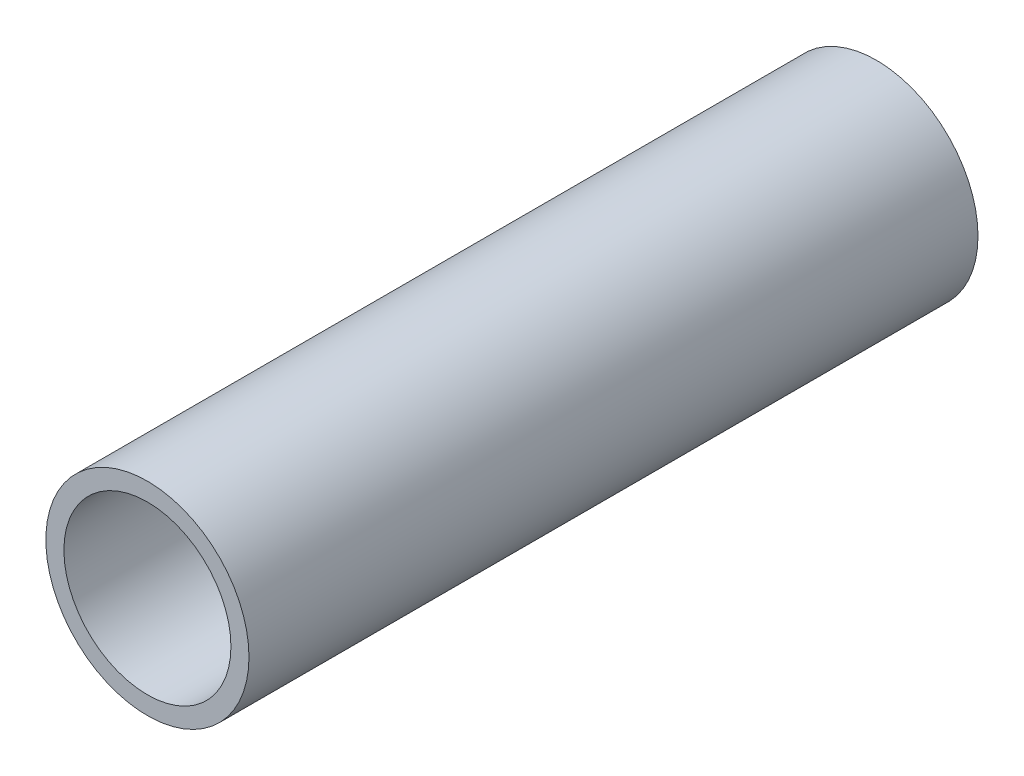
ISO-10303-21;
HEADER;
FILE_DESCRIPTION(('STEP AP214'),'2;1');
FILE_NAME('part.step','',(''),(''),'','','');
FILE_SCHEMA(('AUTOMOTIVE_DESIGN { 1 0 10303 214 1 1 1 1 }'));
ENDSEC;
DATA;
#1=APPLICATION_CONTEXT('core data for automotive mechanical design processes');
#2=APPLICATION_PROTOCOL_DEFINITION('international standard','automotive_design',2000,#1);
#3=PRODUCT_CONTEXT('',#1,'mechanical');
#4=PRODUCT('Part','Part','',(#3));
#5=PRODUCT_RELATED_PRODUCT_CATEGORY('part','',(#4));
#6=PRODUCT_DEFINITION_FORMATION('','',#4);
#7=PRODUCT_DEFINITION_CONTEXT('part definition',#1,'design');
#8=PRODUCT_DEFINITION('design','',#6,#7);
#9=PRODUCT_DEFINITION_SHAPE('','',#8);
#10=(LENGTH_UNIT() NAMED_UNIT(*) SI_UNIT(.MILLI.,.METRE.));
#11=(NAMED_UNIT(*) PLANE_ANGLE_UNIT() SI_UNIT($,.RADIAN.));
#12=(NAMED_UNIT(*) SI_UNIT($,.STERADIAN.) SOLID_ANGLE_UNIT());
#13=UNCERTAINTY_MEASURE_WITH_UNIT(LENGTH_MEASURE(1.E-05),#10,'distance_accuracy_value','');
#14=(GEOMETRIC_REPRESENTATION_CONTEXT(3) GLOBAL_UNCERTAINTY_ASSIGNED_CONTEXT((#13)) GLOBAL_UNIT_ASSIGNED_CONTEXT((#10,
#11,#12)) REPRESENTATION_CONTEXT('',''));
#15=CARTESIAN_POINT('',(0.,0.,0.));
#16=DIRECTION('',(0.,0.,1.));
#17=DIRECTION('',(1.,0.,0.));
#18=AXIS2_PLACEMENT_3D('',#15,#16,#17);
#19=CARTESIAN_POINT('',(0.,0.,609.6));
#20=DIRECTION('',(0.,0.,1.));
#21=DIRECTION('',(1.,0.,0.));
#22=AXIS2_PLACEMENT_3D('',#19,#20,#21);
#23=PLANE('',#22);
#24=CARTESIAN_POINT('',(0.,0.,609.6));
#25=DIRECTION('',(0.,0.,1.));
#26=DIRECTION('',(1.,0.,0.));
#27=AXIS2_PLACEMENT_3D('',#24,#25,#26);
#28=CIRCLE('',#27,84.93125);
#29=CARTESIAN_POINT('',(84.93125,0.,609.6));
#30=VERTEX_POINT('',#29);
#31=EDGE_CURVE('E10',#30,#30,#28,.T.);
#32=ORIENTED_EDGE('',*,*,#31,.T.);
#33=EDGE_LOOP('',(#32));
#34=FACE_BOUND('',#33,.T.);
#35=CARTESIAN_POINT('',(0.,0.,609.6));
#36=DIRECTION('',(0.,0.,1.));
#37=DIRECTION('',(1.,0.,0.));
#38=AXIS2_PLACEMENT_3D('',#35,#36,#37);
#39=CIRCLE('',#38,69.84365);
#40=CARTESIAN_POINT('',(69.84365,0.,609.6));
#41=VERTEX_POINT('',#40);
#42=EDGE_CURVE('E50',#41,#41,#39,.T.);
#43=ORIENTED_EDGE('',*,*,#42,.F.);
#44=EDGE_LOOP('',(#43));
#45=FACE_BOUND('',#44,.T.);
#46=ADVANCED_FACE('F37',(#34,#45),#23,.T.);
#47=CARTESIAN_POINT('',(0.,0.,0.));
#48=DIRECTION('',(0.,0.,1.));
#49=DIRECTION('',(1.,0.,0.));
#50=AXIS2_PLACEMENT_3D('',#47,#48,#49);
#51=PLANE('',#50);
#52=CARTESIAN_POINT('',(0.,0.,0.));
#53=DIRECTION('',(0.,0.,1.));
#54=DIRECTION('',(1.,0.,0.));
#55=AXIS2_PLACEMENT_3D('',#52,#53,#54);
#56=CIRCLE('',#55,84.93125);
#57=CARTESIAN_POINT('',(84.93125,0.,0.));
#58=VERTEX_POINT('',#57);
#59=EDGE_CURVE('E41',#58,#58,#56,.T.);
#60=ORIENTED_EDGE('',*,*,#59,.F.);
#61=EDGE_LOOP('',(#60));
#62=FACE_BOUND('',#61,.T.);
#63=CARTESIAN_POINT('',(0.,0.,0.));
#64=DIRECTION('',(0.,0.,1.));
#65=DIRECTION('',(1.,0.,0.));
#66=AXIS2_PLACEMENT_3D('',#63,#64,#65);
#67=CIRCLE('',#66,69.84365);
#68=CARTESIAN_POINT('',(69.84365,0.,0.));
#69=VERTEX_POINT('',#68);
#70=EDGE_CURVE('E52',#69,#69,#67,.T.);
#71=ORIENTED_EDGE('',*,*,#70,.T.);
#72=EDGE_LOOP('',(#71));
#73=FACE_BOUND('',#72,.T.);
#74=ADVANCED_FACE('F64',(#62,#73),#51,.F.);
#75=CARTESIAN_POINT('',(0.,0.,609.6));
#76=DIRECTION('',(0.,0.,-1.));
#77=DIRECTION('',(-1.,0.,0.));
#78=AXIS2_PLACEMENT_3D('',#75,#76,#77);
#79=CYLINDRICAL_SURFACE('',#78,84.93125);
#80=ORIENTED_EDGE('',*,*,#31,.F.);
#81=EDGE_LOOP('',(#80));
#82=FACE_BOUND('',#81,.T.);
#83=ORIENTED_EDGE('',*,*,#59,.T.);
#84=EDGE_LOOP('',(#83));
#85=FACE_BOUND('',#84,.T.);
#86=ADVANCED_FACE('F39',(#82,#85),#79,.T.);
#87=CARTESIAN_POINT('',(0.,0.,609.6));
#88=DIRECTION('',(0.,0.,-1.));
#89=DIRECTION('',(-1.,0.,0.));
#90=AXIS2_PLACEMENT_3D('',#87,#88,#89);
#91=CYLINDRICAL_SURFACE('',#90,69.84365);
#92=ORIENTED_EDGE('',*,*,#42,.T.);
#93=EDGE_LOOP('',(#92));
#94=FACE_BOUND('',#93,.T.);
#95=ORIENTED_EDGE('',*,*,#70,.F.);
#96=EDGE_LOOP('',(#95));
#97=FACE_BOUND('',#96,.T.);
#98=ADVANCED_FACE('F60',(#94,#97),#91,.F.);
#99=CLOSED_SHELL('',(#46,#74,#86,#98));
#100=MANIFOLD_SOLID_BREP('B2',#99);
#101=ADVANCED_BREP_SHAPE_REPRESENTATION('',(#18,#100),#14);
#102=SHAPE_DEFINITION_REPRESENTATION(#9,#101);
ENDSEC;
END-ISO-10303-21;
